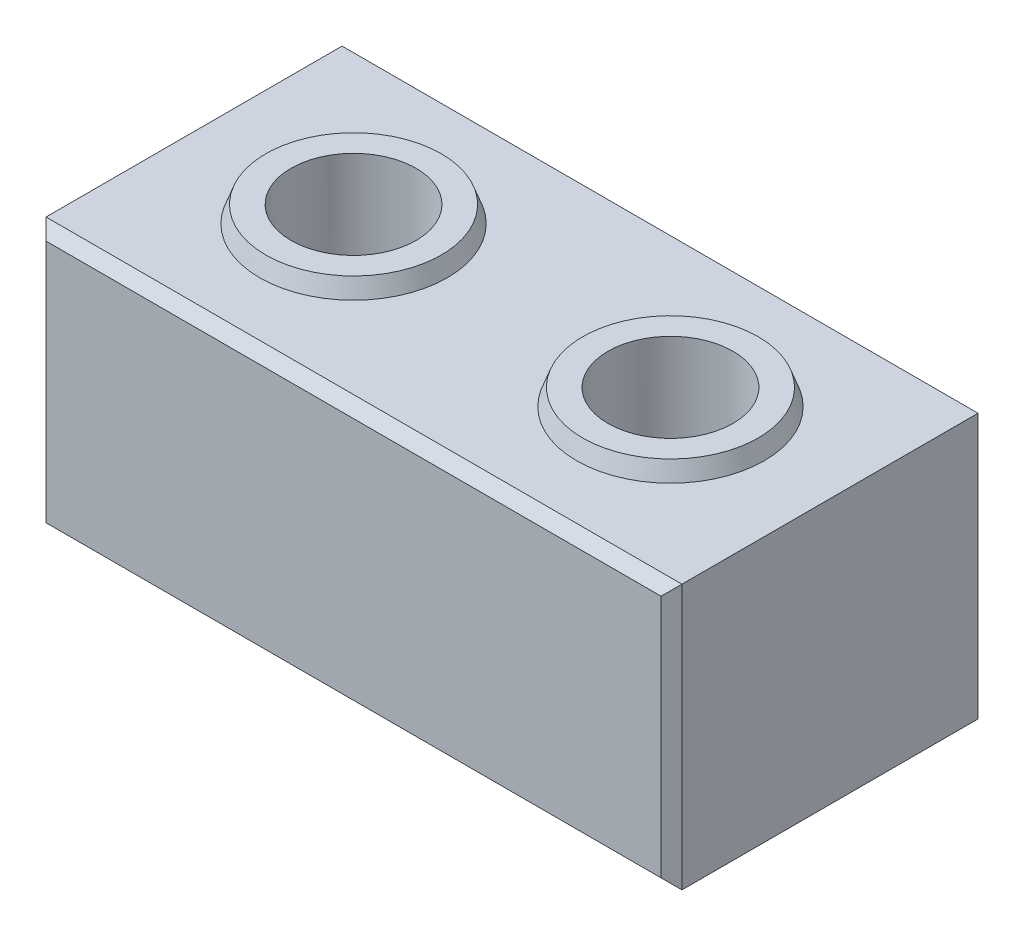
ISO-10303-21;
HEADER;
FILE_DESCRIPTION(('STEP AP214'),'2;1');
FILE_NAME('part.step','',(''),(''),'','','');
FILE_SCHEMA(('AUTOMOTIVE_DESIGN { 1 0 10303 214 1 1 1 1 }'));
ENDSEC;
DATA;
#1=APPLICATION_CONTEXT('core data for automotive mechanical design processes');
#2=APPLICATION_PROTOCOL_DEFINITION('international standard','automotive_design',2000,#1);
#3=PRODUCT_CONTEXT('',#1,'mechanical');
#4=PRODUCT('Part','Part','',(#3));
#5=PRODUCT_RELATED_PRODUCT_CATEGORY('part','',(#4));
#6=PRODUCT_DEFINITION_FORMATION('','',#4);
#7=PRODUCT_DEFINITION_CONTEXT('part definition',#1,'design');
#8=PRODUCT_DEFINITION('design','',#6,#7);
#9=PRODUCT_DEFINITION_SHAPE('','',#8);
#10=(LENGTH_UNIT() NAMED_UNIT(*) SI_UNIT(.MILLI.,.METRE.));
#11=(NAMED_UNIT(*) PLANE_ANGLE_UNIT() SI_UNIT($,.RADIAN.));
#12=(NAMED_UNIT(*) SI_UNIT($,.STERADIAN.) SOLID_ANGLE_UNIT());
#13=UNCERTAINTY_MEASURE_WITH_UNIT(LENGTH_MEASURE(1.E-05),#10,'distance_accuracy_value','');
#14=(GEOMETRIC_REPRESENTATION_CONTEXT(3) GLOBAL_UNCERTAINTY_ASSIGNED_CONTEXT((#13)) GLOBAL_UNIT_ASSIGNED_CONTEXT((#10,
#11,#12)) REPRESENTATION_CONTEXT('',''));
#15=CARTESIAN_POINT('',(0.,0.,0.));
#16=DIRECTION('',(0.,0.,1.));
#17=DIRECTION('',(1.,0.,0.));
#18=AXIS2_PLACEMENT_3D('',#15,#16,#17);
#19=CARTESIAN_POINT('',(-76.,-127.,0.));
#20=DIRECTION('',(0.,1.,0.));
#21=DIRECTION('',(0.,0.,1.));
#22=AXIS2_PLACEMENT_3D('',#19,#20,#21);
#23=CYLINDRICAL_SURFACE('',#22,30.);
#24=CARTESIAN_POINT('',(-76.,8.,0.));
#25=DIRECTION('',(0.,1.,0.));
#26=DIRECTION('',(0.,0.,1.));
#27=AXIS2_PLACEMENT_3D('',#24,#25,#26);
#28=CIRCLE('',#27,30.);
#29=CARTESIAN_POINT('',(-76.,8.,30.));
#30=VERTEX_POINT('',#29);
#31=EDGE_CURVE('E140',#30,#30,#28,.T.);
#32=ORIENTED_EDGE('',*,*,#31,.T.);
#33=EDGE_LOOP('',(#32));
#34=FACE_BOUND('',#33,.T.);
#35=CARTESIAN_POINT('',(-76.,-117.,0.));
#36=DIRECTION('',(0.,-1.,0.));
#37=DIRECTION('',(0.,0.,-1.));
#38=AXIS2_PLACEMENT_3D('',#35,#36,#37);
#39=CIRCLE('',#38,30.);
#40=CARTESIAN_POINT('',(-76.,-117.,-30.));
#41=VERTEX_POINT('',#40);
#42=EDGE_CURVE('E353',#41,#41,#39,.T.);
#43=ORIENTED_EDGE('',*,*,#42,.T.);
#44=EDGE_LOOP('',(#43));
#45=FACE_BOUND('',#44,.T.);
#46=ADVANCED_FACE('F35',(#34,#45),#23,.F.);
#47=CARTESIAN_POINT('',(0.,0.,0.));
#48=DIRECTION('',(0.,1.,0.));
#49=DIRECTION('',(0.,0.,1.));
#50=AXIS2_PLACEMENT_3D('',#47,#48,#49);
#51=PLANE('',#50);
#52=CARTESIAN_POINT('',(-76.,0.,0.));
#53=DIRECTION('',(0.,1.,0.));
#54=DIRECTION('',(0.,0.,1.));
#55=AXIS2_PLACEMENT_3D('',#52,#53,#54);
#56=CIRCLE('',#55,45.);
#57=CARTESIAN_POINT('',(-76.,0.,45.));
#58=VERTEX_POINT('',#57);
#59=EDGE_CURVE('E135',#58,#58,#56,.T.);
#60=ORIENTED_EDGE('',*,*,#59,.F.);
#61=EDGE_LOOP('',(#60));
#62=FACE_BOUND('',#61,.T.);
#63=DIRECTION('',(0.,0.,1.));
#64=VECTOR('',#63,1.);
#65=CARTESIAN_POINT('',(-152.5,0.,76.));
#66=LINE('',#65,#64);
#67=CARTESIAN_POINT('',(-152.5,0.,-71.));
#68=VERTEX_POINT('',#67);
#69=CARTESIAN_POINT('',(-152.5,0.,71.));
#70=VERTEX_POINT('',#69);
#71=EDGE_CURVE('E126',#68,#70,#66,.T.);
#72=ORIENTED_EDGE('',*,*,#71,.T.);
#73=DIRECTION('',(1.,0.,0.));
#74=VECTOR('',#73,1.);
#75=CARTESIAN_POINT('',(0.,0.,71.));
#76=LINE('',#75,#74);
#77=CARTESIAN_POINT('',(152.5,0.,71.));
#78=VERTEX_POINT('',#77);
#79=EDGE_CURVE('E130',#70,#78,#76,.T.);
#80=ORIENTED_EDGE('',*,*,#79,.T.);
#81=DIRECTION('',(0.,0.,-1.));
#82=VECTOR('',#81,1.);
#83=CARTESIAN_POINT('',(152.5,0.,76.));
#84=LINE('',#83,#82);
#85=CARTESIAN_POINT('',(152.5,0.,-71.0000000000001));
#86=VERTEX_POINT('',#85);
#87=EDGE_CURVE('E129',#78,#86,#84,.T.);
#88=ORIENTED_EDGE('',*,*,#87,.T.);
#89=DIRECTION('',(-1.,0.,0.));
#90=VECTOR('',#89,1.);
#91=CARTESIAN_POINT('',(0.,0.,-71.0000000000001));
#92=LINE('',#91,#90);
#93=EDGE_CURVE('E105',#86,#68,#92,.T.);
#94=ORIENTED_EDGE('',*,*,#93,.T.);
#95=EDGE_LOOP('',(#72,#80,#88,#94));
#96=FACE_BOUND('',#95,.T.);
#97=CARTESIAN_POINT('',(76.,0.,0.));
#98=DIRECTION('',(0.,1.,0.));
#99=DIRECTION('',(0.,0.,-1.));
#100=AXIS2_PLACEMENT_3D('',#97,#98,#99);
#101=CIRCLE('',#100,45.);
#102=CARTESIAN_POINT('',(76.,0.,-45.));
#103=VERTEX_POINT('',#102);
#104=EDGE_CURVE('E344',#103,#103,#101,.T.);
#105=ORIENTED_EDGE('',*,*,#104,.F.);
#106=EDGE_LOOP('',(#105));
#107=FACE_BOUND('',#106,.T.);
#108=ADVANCED_FACE('F123',(#62,#96,#107),#51,.T.);
#109=CARTESIAN_POINT('',(-152.5,-127.,76.));
#110=DIRECTION('',(-1.,0.,0.));
#111=DIRECTION('',(0.,0.,1.));
#112=AXIS2_PLACEMENT_3D('',#109,#110,#111);
#113=PLANE('',#112);
#114=DIRECTION('',(0.,0.,1.));
#115=VECTOR('',#114,1.);
#116=CARTESIAN_POINT('',(-152.5,-127.,76.));
#117=LINE('',#116,#115);
#118=CARTESIAN_POINT('',(-152.5,-127.,-71.));
#119=VERTEX_POINT('',#118);
#120=CARTESIAN_POINT('',(-152.5,-127.,71.));
#121=VERTEX_POINT('',#120);
#122=EDGE_CURVE('E137',#119,#121,#117,.T.);
#123=ORIENTED_EDGE('',*,*,#122,.T.);
#124=DIRECTION('',(0.,1.,0.));
#125=VECTOR('',#124,1.);
#126=CARTESIAN_POINT('',(-152.5,-127.,71.));
#127=LINE('',#126,#125);
#128=EDGE_CURVE('E117',#121,#70,#127,.T.);
#129=ORIENTED_EDGE('',*,*,#128,.T.);
#130=ORIENTED_EDGE('',*,*,#71,.F.);
#131=DIRECTION('',(0.,-1.,0.));
#132=VECTOR('',#131,1.);
#133=CARTESIAN_POINT('',(-152.5,-127.,-71.));
#134=LINE('',#133,#132);
#135=EDGE_CURVE('E109',#68,#119,#134,.T.);
#136=ORIENTED_EDGE('',*,*,#135,.T.);
#137=EDGE_LOOP('',(#123,#129,#130,#136));
#138=FACE_BOUND('',#137,.T.);
#139=ADVANCED_FACE('F133',(#138),#113,.T.);
#140=CARTESIAN_POINT('',(152.5,-127.,-76.));
#141=DIRECTION('',(0.,0.,-1.));
#142=DIRECTION('',(-1.,0.,0.));
#143=AXIS2_PLACEMENT_3D('',#140,#141,#142);
#144=PLANE('',#143);
#145=DIRECTION('',(0.,1.,0.));
#146=VECTOR('',#145,1.);
#147=CARTESIAN_POINT('',(-147.5,-127.,-76.));
#148=LINE('',#147,#146);
#149=CARTESIAN_POINT('',(-147.5,-122.,-76.));
#150=VERTEX_POINT('',#149);
#151=CARTESIAN_POINT('',(-147.5,-4.99999999999995,-76.));
#152=VERTEX_POINT('',#151);
#153=EDGE_CURVE('E45',#150,#152,#148,.T.);
#154=ORIENTED_EDGE('',*,*,#153,.T.);
#155=DIRECTION('',(1.,0.,0.));
#156=VECTOR('',#155,1.);
#157=CARTESIAN_POINT('',(152.5,-4.99999999999995,-76.));
#158=LINE('',#157,#156);
#159=CARTESIAN_POINT('',(147.5,-4.99999999999995,-76.));
#160=VERTEX_POINT('',#159);
#161=EDGE_CURVE('E11',#152,#160,#158,.T.);
#162=ORIENTED_EDGE('',*,*,#161,.T.);
#163=DIRECTION('',(0.,-1.,0.));
#164=VECTOR('',#163,1.);
#165=CARTESIAN_POINT('',(147.5,-127.,-76.));
#166=LINE('',#165,#164);
#167=CARTESIAN_POINT('',(147.5,-122.,-76.));
#168=VERTEX_POINT('',#167);
#169=EDGE_CURVE('E177',#160,#168,#166,.T.);
#170=ORIENTED_EDGE('',*,*,#169,.T.);
#171=DIRECTION('',(-1.,0.,0.));
#172=VECTOR('',#171,1.);
#173=CARTESIAN_POINT('',(-152.5,-122.,-76.));
#174=LINE('',#173,#172);
#175=EDGE_CURVE('E175',#168,#150,#174,.T.);
#176=ORIENTED_EDGE('',*,*,#175,.T.);
#177=EDGE_LOOP('',(#154,#162,#170,#176));
#178=FACE_BOUND('',#177,.T.);
#179=ADVANCED_FACE('F199',(#178),#144,.T.);
#180=CARTESIAN_POINT('',(152.5,-127.,76.));
#181=DIRECTION('',(1.,0.,0.));
#182=DIRECTION('',(0.,0.,-1.));
#183=AXIS2_PLACEMENT_3D('',#180,#181,#182);
#184=PLANE('',#183);
#185=ORIENTED_EDGE('',*,*,#87,.F.);
#186=DIRECTION('',(0.,-1.,0.));
#187=VECTOR('',#186,1.);
#188=CARTESIAN_POINT('',(152.5,-127.,71.));
#189=LINE('',#188,#187);
#190=CARTESIAN_POINT('',(152.5,-127.,71.));
#191=VERTEX_POINT('',#190);
#192=EDGE_CURVE('E118',#78,#191,#189,.T.);
#193=ORIENTED_EDGE('',*,*,#192,.T.);
#194=DIRECTION('',(0.,0.,-1.));
#195=VECTOR('',#194,1.);
#196=CARTESIAN_POINT('',(152.5,-127.,76.));
#197=LINE('',#196,#195);
#198=CARTESIAN_POINT('',(152.5,-127.,-71.0000000000001));
#199=VERTEX_POINT('',#198);
#200=EDGE_CURVE('E143',#191,#199,#197,.T.);
#201=ORIENTED_EDGE('',*,*,#200,.T.);
#202=DIRECTION('',(0.,1.,0.));
#203=VECTOR('',#202,1.);
#204=CARTESIAN_POINT('',(152.5,-127.,-71.0000000000001));
#205=LINE('',#204,#203);
#206=EDGE_CURVE('E167',#199,#86,#205,.T.);
#207=ORIENTED_EDGE('',*,*,#206,.T.);
#208=EDGE_LOOP('',(#185,#193,#201,#207));
#209=FACE_BOUND('',#208,.T.);
#210=ADVANCED_FACE('F201',(#209),#184,.T.);
#211=CARTESIAN_POINT('',(152.5,-127.,76.));
#212=DIRECTION('',(0.,0.,1.));
#213=DIRECTION('',(1.,0.,0.));
#214=AXIS2_PLACEMENT_3D('',#211,#212,#213);
#215=PLANE('',#214);
#216=DIRECTION('',(0.,1.,0.));
#217=VECTOR('',#216,1.);
#218=CARTESIAN_POINT('',(147.5,-127.,76.));
#219=LINE('',#218,#217);
#220=CARTESIAN_POINT('',(147.5,-122.,76.));
#221=VERTEX_POINT('',#220);
#222=CARTESIAN_POINT('',(147.5,-4.99999999999995,76.));
#223=VERTEX_POINT('',#222);
#224=EDGE_CURVE('E162',#221,#223,#219,.T.);
#225=ORIENTED_EDGE('',*,*,#224,.T.);
#226=DIRECTION('',(-1.,0.,0.));
#227=VECTOR('',#226,1.);
#228=CARTESIAN_POINT('',(152.5,-4.99999999999995,76.));
#229=LINE('',#228,#227);
#230=CARTESIAN_POINT('',(-147.5,-4.99999999999995,76.));
#231=VERTEX_POINT('',#230);
#232=EDGE_CURVE('E164',#223,#231,#229,.T.);
#233=ORIENTED_EDGE('',*,*,#232,.T.);
#234=DIRECTION('',(0.,-1.,0.));
#235=VECTOR('',#234,1.);
#236=CARTESIAN_POINT('',(-147.5,-127.,76.));
#237=LINE('',#236,#235);
#238=CARTESIAN_POINT('',(-147.5,-122.,76.));
#239=VERTEX_POINT('',#238);
#240=EDGE_CURVE('E160',#231,#239,#237,.T.);
#241=ORIENTED_EDGE('',*,*,#240,.T.);
#242=DIRECTION('',(1.,0.,0.));
#243=VECTOR('',#242,1.);
#244=CARTESIAN_POINT('',(152.5,-122.,76.));
#245=LINE('',#244,#243);
#246=EDGE_CURVE('E158',#239,#221,#245,.T.);
#247=ORIENTED_EDGE('',*,*,#246,.T.);
#248=EDGE_LOOP('',(#225,#233,#241,#247));
#249=FACE_BOUND('',#248,.T.);
#250=ADVANCED_FACE('F207',(#249),#215,.T.);
#251=CARTESIAN_POINT('',(0.,-127.,0.));
#252=DIRECTION('',(0.,1.,0.));
#253=DIRECTION('',(0.,0.,1.));
#254=AXIS2_PLACEMENT_3D('',#251,#252,#253);
#255=PLANE('',#254);
#256=CARTESIAN_POINT('',(-76.,-127.,0.));
#257=DIRECTION('',(0.,-1.,0.));
#258=DIRECTION('',(0.,0.,-1.));
#259=AXIS2_PLACEMENT_3D('',#256,#257,#258);
#260=CIRCLE('',#259,46.);
#261=CARTESIAN_POINT('',(-76.,-127.,-46.));
#262=VERTEX_POINT('',#261);
#263=EDGE_CURVE('E239',#262,#262,#260,.T.);
#264=ORIENTED_EDGE('',*,*,#263,.F.);
#265=EDGE_LOOP('',(#264));
#266=FACE_BOUND('',#265,.T.);
#267=CARTESIAN_POINT('',(76.,-127.,0.));
#268=DIRECTION('',(0.,-1.,0.));
#269=DIRECTION('',(0.,0.,1.));
#270=AXIS2_PLACEMENT_3D('',#267,#268,#269);
#271=CIRCLE('',#270,46.);
#272=CARTESIAN_POINT('',(76.,-127.,46.));
#273=VERTEX_POINT('',#272);
#274=EDGE_CURVE('E243',#273,#273,#271,.T.);
#275=ORIENTED_EDGE('',*,*,#274,.F.);
#276=EDGE_LOOP('',(#275));
#277=FACE_BOUND('',#276,.T.);
#278=ORIENTED_EDGE('',*,*,#200,.F.);
#279=DIRECTION('',(-1.,0.,0.));
#280=VECTOR('',#279,1.);
#281=CARTESIAN_POINT('',(-152.5,-127.,71.));
#282=LINE('',#281,#280);
#283=EDGE_CURVE('E173',#191,#121,#282,.T.);
#284=ORIENTED_EDGE('',*,*,#283,.T.);
#285=ORIENTED_EDGE('',*,*,#122,.F.);
#286=DIRECTION('',(1.,0.,0.));
#287=VECTOR('',#286,1.);
#288=CARTESIAN_POINT('',(152.5,-127.,-71.0000000000001));
#289=LINE('',#288,#287);
#290=EDGE_CURVE('E171',#119,#199,#289,.T.);
#291=ORIENTED_EDGE('',*,*,#290,.T.);
#292=EDGE_LOOP('',(#278,#284,#285,#291));
#293=FACE_BOUND('',#292,.T.);
#294=ADVANCED_FACE('F225',(#266,#277,#293),#255,.F.);
#295=CARTESIAN_POINT('',(76.,-127.,0.));
#296=DIRECTION('',(0.,1.,0.));
#297=DIRECTION('',(0.,0.,1.));
#298=AXIS2_PLACEMENT_3D('',#295,#296,#297);
#299=CYLINDRICAL_SURFACE('',#298,30.);
#300=CARTESIAN_POINT('',(76.,-117.,0.));
#301=DIRECTION('',(0.,-1.,0.));
#302=DIRECTION('',(0.,0.,1.));
#303=AXIS2_PLACEMENT_3D('',#300,#301,#302);
#304=CIRCLE('',#303,30.);
#305=CARTESIAN_POINT('',(76.,-117.,30.));
#306=VERTEX_POINT('',#305);
#307=EDGE_CURVE('E189',#306,#306,#304,.T.);
#308=ORIENTED_EDGE('',*,*,#307,.T.);
#309=EDGE_LOOP('',(#308));
#310=FACE_BOUND('',#309,.T.);
#311=CARTESIAN_POINT('',(76.,8.,0.));
#312=DIRECTION('',(0.,1.,0.));
#313=DIRECTION('',(0.,0.,-1.));
#314=AXIS2_PLACEMENT_3D('',#311,#312,#313);
#315=CIRCLE('',#314,30.);
#316=CARTESIAN_POINT('',(76.,8.,-30.));
#317=VERTEX_POINT('',#316);
#318=EDGE_CURVE('E349',#317,#317,#315,.T.);
#319=ORIENTED_EDGE('',*,*,#318,.T.);
#320=EDGE_LOOP('',(#319));
#321=FACE_BOUND('',#320,.T.);
#322=ADVANCED_FACE('F223',(#310,#321),#299,.F.);
#323=CARTESIAN_POINT('',(-76.,8.,0.));
#324=DIRECTION('',(0.,1.,0.));
#325=DIRECTION('',(0.,0.,1.));
#326=AXIS2_PLACEMENT_3D('',#323,#324,#325);
#327=PLANE('',#326);
#328=CARTESIAN_POINT('',(-76.,8.,0.));
#329=DIRECTION('',(0.,1.,0.));
#330=DIRECTION('',(0.,0.,1.));
#331=AXIS2_PLACEMENT_3D('',#328,#329,#330);
#332=CIRCLE('',#331,42.0882381258704);
#333=CARTESIAN_POINT('',(-76.,8.,42.0882381258704));
#334=VERTEX_POINT('',#333);
#335=EDGE_CURVE('E149',#334,#334,#332,.T.);
#336=ORIENTED_EDGE('',*,*,#335,.T.);
#337=EDGE_LOOP('',(#336));
#338=FACE_BOUND('',#337,.T.);
#339=ORIENTED_EDGE('',*,*,#31,.F.);
#340=EDGE_LOOP('',(#339));
#341=FACE_BOUND('',#340,.T.);
#342=ADVANCED_FACE('F232',(#338,#341),#327,.T.);
#343=CARTESIAN_POINT('',(76.,8.,0.));
#344=DIRECTION('',(0.,-1.,0.));
#345=DIRECTION('',(0.,0.,-1.));
#346=AXIS2_PLACEMENT_3D('',#343,#344,#345);
#347=PLANE('',#346);
#348=CARTESIAN_POINT('',(76.,8.,0.));
#349=DIRECTION('',(0.,-1.,0.));
#350=DIRECTION('',(0.,0.,-1.));
#351=AXIS2_PLACEMENT_3D('',#348,#349,#350);
#352=CIRCLE('',#351,42.0882381258704);
#353=CARTESIAN_POINT('',(76.,8.,-42.0882381258704));
#354=VERTEX_POINT('',#353);
#355=EDGE_CURVE('E146',#354,#354,#352,.F.);
#356=ORIENTED_EDGE('',*,*,#355,.T.);
#357=EDGE_LOOP('',(#356));
#358=FACE_BOUND('',#357,.T.);
#359=ORIENTED_EDGE('',*,*,#318,.F.);
#360=EDGE_LOOP('',(#359));
#361=FACE_BOUND('',#360,.T.);
#362=ADVANCED_FACE('F334',(#358,#361),#347,.F.);
#363=CARTESIAN_POINT('',(76.,8.,0.));
#364=DIRECTION('',(0.,-1.,0.));
#365=DIRECTION('',(0.,0.,-1.));
#366=AXIS2_PLACEMENT_3D('',#363,#364,#365);
#367=CONICAL_SURFACE('',#366,42.0882381258704,0.349065850398863);
#368=ORIENTED_EDGE('',*,*,#104,.T.);
#369=EDGE_LOOP('',(#368));
#370=FACE_BOUND('',#369,.T.);
#371=ORIENTED_EDGE('',*,*,#355,.F.);
#372=EDGE_LOOP('',(#371));
#373=FACE_BOUND('',#372,.T.);
#374=ADVANCED_FACE('F329',(#370,#373),#367,.T.);
#375=CARTESIAN_POINT('',(-76.,8.,0.));
#376=DIRECTION('',(0.,-1.,0.));
#377=DIRECTION('',(0.,0.,-1.));
#378=AXIS2_PLACEMENT_3D('',#375,#376,#377);
#379=CONICAL_SURFACE('',#378,42.0882381258704,0.349065850398861);
#380=ORIENTED_EDGE('',*,*,#59,.T.);
#381=EDGE_LOOP('',(#380));
#382=FACE_BOUND('',#381,.T.);
#383=ORIENTED_EDGE('',*,*,#335,.F.);
#384=EDGE_LOOP('',(#383));
#385=FACE_BOUND('',#384,.T.);
#386=ADVANCED_FACE('F322',(#382,#385),#379,.T.);
#387=CARTESIAN_POINT('',(76.,-117.,0.));
#388=DIRECTION('',(0.,1.,0.));
#389=DIRECTION('',(0.,0.,1.));
#390=AXIS2_PLACEMENT_3D('',#387,#388,#389);
#391=PLANE('',#390);
#392=CARTESIAN_POINT('',(76.,-117.,0.));
#393=DIRECTION('',(0.,1.,0.));
#394=DIRECTION('',(0.,0.,1.));
#395=AXIS2_PLACEMENT_3D('',#392,#393,#394);
#396=CIRCLE('',#395,42.3602976573379);
#397=CARTESIAN_POINT('',(76.,-117.,42.3602976573379));
#398=VERTEX_POINT('',#397);
#399=EDGE_CURVE('E152',#398,#398,#396,.F.);
#400=ORIENTED_EDGE('',*,*,#399,.T.);
#401=EDGE_LOOP('',(#400));
#402=FACE_BOUND('',#401,.T.);
#403=ORIENTED_EDGE('',*,*,#307,.F.);
#404=EDGE_LOOP('',(#403));
#405=FACE_BOUND('',#404,.T.);
#406=ADVANCED_FACE('F328',(#402,#405),#391,.F.);
#407=CARTESIAN_POINT('',(-76.,-117.,0.));
#408=DIRECTION('',(0.,-1.,0.));
#409=DIRECTION('',(0.,0.,-1.));
#410=AXIS2_PLACEMENT_3D('',#407,#408,#409);
#411=PLANE('',#410);
#412=CARTESIAN_POINT('',(-76.,-117.,0.));
#413=DIRECTION('',(0.,-1.,0.));
#414=DIRECTION('',(0.,0.,-1.));
#415=AXIS2_PLACEMENT_3D('',#412,#413,#414);
#416=CIRCLE('',#415,42.3602976573381);
#417=CARTESIAN_POINT('',(-76.,-117.,-42.3602976573381));
#418=VERTEX_POINT('',#417);
#419=EDGE_CURVE('E131',#418,#418,#416,.T.);
#420=ORIENTED_EDGE('',*,*,#419,.T.);
#421=EDGE_LOOP('',(#420));
#422=FACE_BOUND('',#421,.T.);
#423=ORIENTED_EDGE('',*,*,#42,.F.);
#424=EDGE_LOOP('',(#423));
#425=FACE_BOUND('',#424,.T.);
#426=ADVANCED_FACE('F320',(#422,#425),#411,.T.);
#427=CARTESIAN_POINT('',(76.,-117.,0.));
#428=DIRECTION('',(0.,-1.,0.));
#429=DIRECTION('',(0.,0.,-1.));
#430=AXIS2_PLACEMENT_3D('',#427,#428,#429);
#431=CONICAL_SURFACE('',#430,42.3602976573379,0.349065850398868);
#432=ORIENTED_EDGE('',*,*,#274,.T.);
#433=EDGE_LOOP('',(#432));
#434=FACE_BOUND('',#433,.T.);
#435=ORIENTED_EDGE('',*,*,#399,.F.);
#436=EDGE_LOOP('',(#435));
#437=FACE_BOUND('',#436,.T.);
#438=ADVANCED_FACE('F313',(#434,#437),#431,.F.);
#439=CARTESIAN_POINT('',(-76.,-117.,0.));
#440=DIRECTION('',(0.,-1.,0.));
#441=DIRECTION('',(0.,0.,-1.));
#442=AXIS2_PLACEMENT_3D('',#439,#440,#441);
#443=CONICAL_SURFACE('',#442,42.3602976573381,0.349065850398869);
#444=ORIENTED_EDGE('',*,*,#263,.T.);
#445=EDGE_LOOP('',(#444));
#446=FACE_BOUND('',#445,.T.);
#447=ORIENTED_EDGE('',*,*,#419,.F.);
#448=EDGE_LOOP('',(#447));
#449=FACE_BOUND('',#448,.T.);
#450=ADVANCED_FACE('F271',(#446,#449),#443,.F.);
#451=CARTESIAN_POINT('',(152.5,-122.,76.));
#452=DIRECTION('',(0.,-0.707106781186547,0.707106781186547));
#453=DIRECTION('',(-1.,0.,0.));
#454=AXIS2_PLACEMENT_3D('',#451,#452,#453);
#455=PLANE('',#454);
#456=DIRECTION('',(0.577350269189626,-0.577350269189626,-0.577350269189626));
#457=VECTOR('',#456,1.);
#458=CARTESIAN_POINT('',(149.166666666667,-123.666666666667,74.3333333333333));
#459=LINE('',#458,#457);
#460=EDGE_CURVE('E184',#221,#191,#459,.T.);
#461=ORIENTED_EDGE('',*,*,#460,.F.);
#462=ORIENTED_EDGE('',*,*,#246,.F.);
#463=DIRECTION('',(0.577350269189626,0.577350269189626,0.577350269189626));
#464=VECTOR('',#463,1.);
#465=CARTESIAN_POINT('',(-47.5000000000001,-22.0000000000001,176.));
#466=LINE('',#465,#464);
#467=EDGE_CURVE('E187',#121,#239,#466,.T.);
#468=ORIENTED_EDGE('',*,*,#467,.F.);
#469=ORIENTED_EDGE('',*,*,#283,.F.);
#470=EDGE_LOOP('',(#461,#462,#468,#469));
#471=FACE_BOUND('',#470,.T.);
#472=ADVANCED_FACE('F250',(#471),#455,.T.);
#473=CARTESIAN_POINT('',(-152.5,-127.,71.));
#474=DIRECTION('',(0.707106781186547,0.,-0.707106781186547));
#475=DIRECTION('',(0.,1.,0.));
#476=AXIS2_PLACEMENT_3D('',#473,#474,#475);
#477=PLANE('',#476);
#478=ORIENTED_EDGE('',*,*,#467,.T.);
#479=ORIENTED_EDGE('',*,*,#240,.F.);
#480=DIRECTION('',(-0.577350269189626,0.577350269189626,-0.577350269189626));
#481=VECTOR('',#480,1.);
#482=CARTESIAN_POINT('',(-110.166666666667,-42.3333333333333,113.333333333333));
#483=LINE('',#482,#481);
#484=EDGE_CURVE('E182',#70,#231,#483,.F.);
#485=ORIENTED_EDGE('',*,*,#484,.F.);
#486=ORIENTED_EDGE('',*,*,#128,.F.);
#487=EDGE_LOOP('',(#478,#479,#485,#486));
#488=FACE_BOUND('',#487,.T.);
#489=ADVANCED_FACE('F263',(#488),#477,.F.);
#490=CARTESIAN_POINT('',(147.5,-127.,76.));
#491=DIRECTION('',(-0.707106781186547,0.,-0.707106781186547));
#492=DIRECTION('',(0.,1.,0.));
#493=AXIS2_PLACEMENT_3D('',#490,#491,#492);
#494=PLANE('',#493);
#495=ORIENTED_EDGE('',*,*,#460,.T.);
#496=ORIENTED_EDGE('',*,*,#192,.F.);
#497=DIRECTION('',(-0.577350269189626,-0.577350269189626,0.577350269189626));
#498=VECTOR('',#497,1.);
#499=CARTESIAN_POINT('',(106.833333333333,-45.6666666666667,116.666666666667));
#500=LINE('',#499,#498);
#501=EDGE_CURVE('E180',#223,#78,#500,.F.);
#502=ORIENTED_EDGE('',*,*,#501,.F.);
#503=ORIENTED_EDGE('',*,*,#224,.F.);
#504=EDGE_LOOP('',(#495,#496,#502,#503));
#505=FACE_BOUND('',#504,.T.);
#506=ADVANCED_FACE('F255',(#505),#494,.F.);
#507=CARTESIAN_POINT('',(0.,0.,71.));
#508=DIRECTION('',(0.,-0.707106781186547,-0.707106781186547));
#509=DIRECTION('',(1.,0.,0.));
#510=AXIS2_PLACEMENT_3D('',#507,#508,#509);
#511=PLANE('',#510);
#512=ORIENTED_EDGE('',*,*,#484,.T.);
#513=ORIENTED_EDGE('',*,*,#232,.F.);
#514=ORIENTED_EDGE('',*,*,#501,.T.);
#515=ORIENTED_EDGE('',*,*,#79,.F.);
#516=EDGE_LOOP('',(#512,#513,#514,#515));
#517=FACE_BOUND('',#516,.T.);
#518=ADVANCED_FACE('F259',(#517),#511,.F.);
#519=CARTESIAN_POINT('',(152.5,-122.,-76.));
#520=DIRECTION('',(0.,-0.707106781186548,-0.707106781186547));
#521=DIRECTION('',(1.,0.,0.));
#522=AXIS2_PLACEMENT_3D('',#519,#520,#521);
#523=PLANE('',#522);
#524=DIRECTION('',(-0.577350269189624,-0.577350269189626,0.577350269189627));
#525=VECTOR('',#524,1.);
#526=CARTESIAN_POINT('',(-47.5000000000007,-22.0000000000003,-176.));
#527=LINE('',#526,#525);
#528=EDGE_CURVE('E112',#150,#119,#527,.T.);
#529=ORIENTED_EDGE('',*,*,#528,.F.);
#530=ORIENTED_EDGE('',*,*,#175,.F.);
#531=DIRECTION('',(-0.577350269189627,0.577350269189625,-0.577350269189626));
#532=VECTOR('',#531,1.);
#533=CARTESIAN_POINT('',(149.166666666667,-123.666666666667,-74.3333333333334));
#534=LINE('',#533,#532);
#535=EDGE_CURVE('E40',#199,#168,#534,.T.);
#536=ORIENTED_EDGE('',*,*,#535,.F.);
#537=ORIENTED_EDGE('',*,*,#290,.F.);
#538=EDGE_LOOP('',(#529,#530,#536,#537));
#539=FACE_BOUND('',#538,.T.);
#540=ADVANCED_FACE('F38',(#539),#523,.T.);
#541=CARTESIAN_POINT('',(152.5,-127.,-71.0000000000001));
#542=DIRECTION('',(-0.707106781186546,0.,0.707106781186548));
#543=DIRECTION('',(0.,1.,0.));
#544=AXIS2_PLACEMENT_3D('',#541,#542,#543);
#545=PLANE('',#544);
#546=ORIENTED_EDGE('',*,*,#535,.T.);
#547=ORIENTED_EDGE('',*,*,#169,.F.);
#548=DIRECTION('',(0.577350269189627,0.577350269189625,0.577350269189626));
#549=VECTOR('',#548,1.);
#550=CARTESIAN_POINT('',(110.166666666667,-42.3333333333332,-113.333333333333));
#551=LINE('',#550,#549);
#552=EDGE_CURVE('E58',#86,#160,#551,.F.);
#553=ORIENTED_EDGE('',*,*,#552,.F.);
#554=ORIENTED_EDGE('',*,*,#206,.F.);
#555=EDGE_LOOP('',(#546,#547,#553,#554));
#556=FACE_BOUND('',#555,.T.);
#557=ADVANCED_FACE('F195',(#556),#545,.F.);
#558=CARTESIAN_POINT('',(-147.5,-127.,-76.));
#559=DIRECTION('',(0.707106781186549,0.,0.707106781186546));
#560=DIRECTION('',(0.,1.,0.));
#561=AXIS2_PLACEMENT_3D('',#558,#559,#560);
#562=PLANE('',#561);
#563=ORIENTED_EDGE('',*,*,#528,.T.);
#564=ORIENTED_EDGE('',*,*,#135,.F.);
#565=DIRECTION('',(0.577350269189624,-0.577350269189626,-0.577350269189627));
#566=VECTOR('',#565,1.);
#567=CARTESIAN_POINT('',(-106.833333333333,-45.6666666666667,-116.666666666667));
#568=LINE('',#567,#566);
#569=EDGE_CURVE('E101',#152,#68,#568,.F.);
#570=ORIENTED_EDGE('',*,*,#569,.F.);
#571=ORIENTED_EDGE('',*,*,#153,.F.);
#572=EDGE_LOOP('',(#563,#564,#570,#571));
#573=FACE_BOUND('',#572,.T.);
#574=ADVANCED_FACE('F110',(#573),#562,.F.);
#575=CARTESIAN_POINT('',(0.,0.,-71.0000000000001));
#576=DIRECTION('',(0.,-0.707106781186548,0.707106781186547));
#577=DIRECTION('',(-1.,0.,0.));
#578=AXIS2_PLACEMENT_3D('',#575,#576,#577);
#579=PLANE('',#578);
#580=ORIENTED_EDGE('',*,*,#552,.T.);
#581=ORIENTED_EDGE('',*,*,#161,.F.);
#582=ORIENTED_EDGE('',*,*,#569,.T.);
#583=ORIENTED_EDGE('',*,*,#93,.F.);
#584=EDGE_LOOP('',(#580,#581,#582,#583));
#585=FACE_BOUND('',#584,.T.);
#586=ADVANCED_FACE('F103',(#585),#579,.F.);
#587=CLOSED_SHELL('',(#46,#108,#139,#179,#210,#250,#294,#322,#342,#362,#374,#386,#406,#426,#438,
#450,#472,#489,#506,#518,#540,#557,#574,#586));
#588=MANIFOLD_SOLID_BREP('B2',#587);
#589=ADVANCED_BREP_SHAPE_REPRESENTATION('',(#18,#588),#14);
#590=SHAPE_DEFINITION_REPRESENTATION(#9,#589);
ENDSEC;
END-ISO-10303-21;
